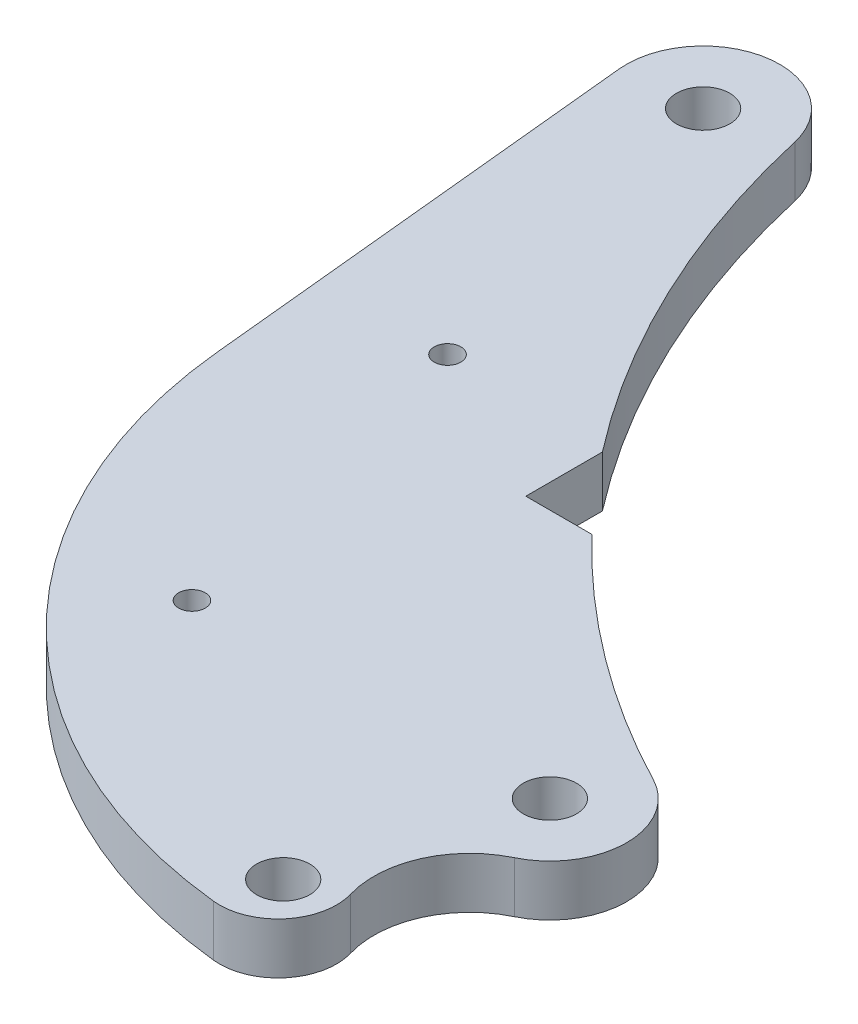
ISO-10303-21;
HEADER;
FILE_DESCRIPTION(('STEP AP214'),'2;1');
FILE_NAME('part.step','',(''),(''),'','','');
FILE_SCHEMA(('AUTOMOTIVE_DESIGN { 1 0 10303 214 1 1 1 1 }'));
ENDSEC;
DATA;
#1=APPLICATION_CONTEXT('core data for automotive mechanical design processes');
#2=APPLICATION_PROTOCOL_DEFINITION('international standard','automotive_design',2000,#1);
#3=PRODUCT_CONTEXT('',#1,'mechanical');
#4=PRODUCT('Part','Part','',(#3));
#5=PRODUCT_RELATED_PRODUCT_CATEGORY('part','',(#4));
#6=PRODUCT_DEFINITION_FORMATION('','',#4);
#7=PRODUCT_DEFINITION_CONTEXT('part definition',#1,'design');
#8=PRODUCT_DEFINITION('design','',#6,#7);
#9=PRODUCT_DEFINITION_SHAPE('','',#8);
#10=(LENGTH_UNIT() NAMED_UNIT(*) SI_UNIT(.MILLI.,.METRE.));
#11=(NAMED_UNIT(*) PLANE_ANGLE_UNIT() SI_UNIT($,.RADIAN.));
#12=(NAMED_UNIT(*) SI_UNIT($,.STERADIAN.) SOLID_ANGLE_UNIT());
#13=UNCERTAINTY_MEASURE_WITH_UNIT(LENGTH_MEASURE(1.E-05),#10,'distance_accuracy_value','');
#14=(GEOMETRIC_REPRESENTATION_CONTEXT(3) GLOBAL_UNCERTAINTY_ASSIGNED_CONTEXT((#13)) GLOBAL_UNIT_ASSIGNED_CONTEXT((#10,
#11,#12)) REPRESENTATION_CONTEXT('',''));
#15=CARTESIAN_POINT('',(0.,0.,0.));
#16=DIRECTION('',(0.,0.,1.));
#17=DIRECTION('',(1.,0.,0.));
#18=AXIS2_PLACEMENT_3D('',#15,#16,#17);
#19=CARTESIAN_POINT('',(0.,3.048,0.));
#20=DIRECTION('',(0.,1.,0.));
#21=DIRECTION('',(0.,0.,1.));
#22=AXIS2_PLACEMENT_3D('',#19,#20,#21);
#23=PLANE('',#22);
#24=CARTESIAN_POINT('',(10.16,3.048,40.64));
#25=DIRECTION('',(0.,1.,0.));
#26=DIRECTION('',(0.,0.,1.));
#27=AXIS2_PLACEMENT_3D('',#24,#25,#26);
#28=CIRCLE('',#27,1.5875);
#29=CARTESIAN_POINT('',(10.16,3.048,42.2275));
#30=VERTEX_POINT('',#29);
#31=EDGE_CURVE('E233',#30,#30,#28,.T.);
#32=ORIENTED_EDGE('',*,*,#31,.F.);
#33=EDGE_LOOP('',(#32));
#34=FACE_BOUND('',#33,.T.);
#35=CARTESIAN_POINT('',(62.1230111231787,3.048,80.394598630688));
#36=DIRECTION('',(0.,1.,0.));
#37=DIRECTION('',(0.,0.,1.));
#38=AXIS2_PLACEMENT_3D('',#35,#36,#37);
#39=CIRCLE('',#38,3.175);
#40=CARTESIAN_POINT('',(62.1230111231787,3.048,83.569598630688));
#41=VERTEX_POINT('',#40);
#42=EDGE_CURVE('E221',#41,#41,#39,.T.);
#43=ORIENTED_EDGE('',*,*,#42,.F.);
#44=EDGE_LOOP('',(#43));
#45=FACE_BOUND('',#44,.T.);
#46=CARTESIAN_POINT('',(0.,3.048,0.));
#47=DIRECTION('',(0.,1.,0.));
#48=DIRECTION('',(0.,0.,1.));
#49=AXIS2_PLACEMENT_3D('',#46,#47,#48);
#50=CIRCLE('',#49,9.14400000000001);
#51=CARTESIAN_POINT('',(8.91502982381273,3.048,-2.03346483631509));
#52=VERTEX_POINT('',#51);
#53=CARTESIAN_POINT('',(-9.09923524379032,3.048,0.903689093750812));
#54=VERTEX_POINT('',#53);
#55=EDGE_CURVE('E170',#52,#54,#50,.T.);
#56=ORIENTED_EDGE('',*,*,#55,.T.);
#57=DIRECTION('',(0.0988286410488635,0.,0.995104466731224));
#58=VECTOR('',#57,1.);
#59=CARTESIAN_POINT('',(-9.09923524379032,3.048,0.903689093750812));
#60=LINE('',#59,#58);
#61=CARTESIAN_POINT('',(-3.80757133563289,3.048,54.1853930164458));
#62=VERTEX_POINT('',#61);
#63=EDGE_CURVE('E108',#54,#62,#60,.T.);
#64=ORIENTED_EDGE('',*,*,#63,.T.);
#65=CARTESIAN_POINT('',(59.3815623017999,3.048,47.9097743098429));
#66=DIRECTION('',(0.,1.,0.));
#67=DIRECTION('',(0.,0.,-1.));
#68=AXIS2_PLACEMENT_3D('',#65,#66,#67);
#69=CIRCLE('',#68,63.5);
#70=CARTESIAN_POINT('',(52.6784219206597,3.048,111.054987184856));
#71=VERTEX_POINT('',#70);
#72=EDGE_CURVE('E191',#62,#71,#69,.T.);
#73=ORIENTED_EDGE('',*,*,#72,.T.);
#74=CARTESIAN_POINT('',(53.4157673625851,3.048,104.109013768605));
#75=DIRECTION('',(0.,1.,0.));
#76=DIRECTION('',(0.,0.,1.));
#77=AXIS2_PLACEMENT_3D('',#74,#75,#76);
#78=CIRCLE('',#77,6.985);
#79=CARTESIAN_POINT('',(60.1171702292743,3.048,102.138880621243));
#80=VERTEX_POINT('',#79);
#81=EDGE_CURVE('E210',#71,#80,#78,.T.);
#82=ORIENTED_EDGE('',*,*,#81,.T.);
#83=CARTESIAN_POINT('',(71.0831021929474,3.048,98.9150263801071));
#84=DIRECTION('',(0.,-1.,0.));
#85=DIRECTION('',(0.,0.,-1.));
#86=AXIS2_PLACEMENT_3D('',#83,#84,#85);
#87=CIRCLE('',#86,11.43);
#88=CARTESIAN_POINT('',(66.1052738208537,3.048,88.6258998526521));
#89=VERTEX_POINT('',#88);
#90=EDGE_CURVE('E207',#80,#89,#87,.T.);
#91=ORIENTED_EDGE('',*,*,#90,.T.);
#92=CARTESIAN_POINT('',(62.1230111231787,3.048,80.394598630688));
#93=DIRECTION('',(0.,1.,0.));
#94=DIRECTION('',(0.,0.,1.));
#95=AXIS2_PLACEMENT_3D('',#92,#93,#94);
#96=CIRCLE('',#95,9.144);
#97=CARTESIAN_POINT('',(66.3396619544821,3.048,72.2808700323882));
#98=VERTEX_POINT('',#97);
#99=EDGE_CURVE('E209',#89,#98,#96,.T.);
#100=ORIENTED_EDGE('',*,*,#99,.T.);
#101=CARTESIAN_POINT('',(117.876505448191,3.048,-26.8869239468317));
#102=DIRECTION('',(0.,-1.,0.));
#103=DIRECTION('',(0.,0.,1.));
#104=AXIS2_PLACEMENT_3D('',#101,#102,#103);
#105=CIRCLE('',#104,111.76);
#106=CARTESIAN_POINT('',(37.3478982086017,3.048,50.6078566261337));
#107=VERTEX_POINT('',#106);
#108=EDGE_CURVE('E133',#98,#107,#105,.T.);
#109=ORIENTED_EDGE('',*,*,#108,.T.);
#110=DIRECTION('',(-1.,0.,0.));
#111=VECTOR('',#110,1.);
#112=CARTESIAN_POINT('',(29.464,3.048,50.6078566261337));
#113=LINE('',#112,#111);
#114=CARTESIAN_POINT('',(29.464,3.048,50.6078566261337));
#115=VERTEX_POINT('',#114);
#116=EDGE_CURVE('E127',#107,#115,#113,.T.);
#117=ORIENTED_EDGE('',*,*,#116,.T.);
#118=DIRECTION('',(0.,0.,-1.));
#119=VECTOR('',#118,1.);
#120=CARTESIAN_POINT('',(29.464,3.048,41.4762714171482));
#121=LINE('',#120,#119);
#122=CARTESIAN_POINT('',(29.464,3.048,41.4762714171481));
#123=VERTEX_POINT('',#122);
#124=EDGE_CURVE('E131',#115,#123,#121,.T.);
#125=ORIENTED_EDGE('',*,*,#124,.T.);
#126=CARTESIAN_POINT('',(117.876505448191,3.048,-26.8869239468317));
#127=DIRECTION('',(0.,-1.,0.));
#128=DIRECTION('',(0.,0.,1.));
#129=AXIS2_PLACEMENT_3D('',#126,#127,#128);
#130=CIRCLE('',#129,111.76);
#131=EDGE_CURVE('E59',#123,#52,#130,.T.);
#132=ORIENTED_EDGE('',*,*,#131,.T.);
#133=EDGE_LOOP('',(#56,#64,#73,#82,#91,#100,#109,#117,#125,#132));
#134=FACE_BOUND('',#133,.T.);
#135=CARTESIAN_POINT('',(0.,3.048,0.));
#136=DIRECTION('',(0.,1.,0.));
#137=DIRECTION('',(0.,0.,1.));
#138=AXIS2_PLACEMENT_3D('',#135,#136,#137);
#139=CIRCLE('',#138,3.175);
#140=CARTESIAN_POINT('',(0.,3.048,3.175));
#141=VERTEX_POINT('',#140);
#142=EDGE_CURVE('E155',#141,#141,#139,.T.);
#143=ORIENTED_EDGE('',*,*,#142,.F.);
#144=EDGE_LOOP('',(#143));
#145=FACE_BOUND('',#144,.T.);
#146=CARTESIAN_POINT('',(54.5672350025058,3.048,104.644758366539));
#147=DIRECTION('',(0.,1.,0.));
#148=DIRECTION('',(0.,0.,1.));
#149=AXIS2_PLACEMENT_3D('',#146,#147,#148);
#150=CIRCLE('',#149,3.175);
#151=CARTESIAN_POINT('',(54.5672350025058,3.048,107.819758366539));
#152=VERTEX_POINT('',#151);
#153=EDGE_CURVE('E227',#152,#152,#150,.T.);
#154=ORIENTED_EDGE('',*,*,#153,.F.);
#155=EDGE_LOOP('',(#154));
#156=FACE_BOUND('',#155,.T.);
#157=CARTESIAN_POINT('',(20.32,3.048,81.28));
#158=DIRECTION('',(0.,1.,0.));
#159=DIRECTION('',(0.,0.,1.));
#160=AXIS2_PLACEMENT_3D('',#157,#158,#159);
#161=CIRCLE('',#160,1.58750000000001);
#162=CARTESIAN_POINT('',(20.32,3.048,82.8675));
#163=VERTEX_POINT('',#162);
#164=EDGE_CURVE('E239',#163,#163,#161,.T.);
#165=ORIENTED_EDGE('',*,*,#164,.F.);
#166=EDGE_LOOP('',(#165));
#167=FACE_BOUND('',#166,.T.);
#168=ADVANCED_FACE('F42',(#34,#45,#134,#145,#156,#167),#23,.T.);
#169=CARTESIAN_POINT('',(0.,-3.048,0.));
#170=DIRECTION('',(0.,1.,0.));
#171=DIRECTION('',(0.,0.,1.));
#172=AXIS2_PLACEMENT_3D('',#169,#170,#171);
#173=PLANE('',#172);
#174=CARTESIAN_POINT('',(0.,-3.048,0.));
#175=DIRECTION('',(0.,1.,0.));
#176=DIRECTION('',(0.,0.,1.));
#177=AXIS2_PLACEMENT_3D('',#174,#175,#176);
#178=CIRCLE('',#177,9.14400000000001);
#179=CARTESIAN_POINT('',(8.91502982381273,-3.048,-2.03346483631509));
#180=VERTEX_POINT('',#179);
#181=CARTESIAN_POINT('',(-9.09923524379032,-3.048,0.903689093750812));
#182=VERTEX_POINT('',#181);
#183=EDGE_CURVE('E151',#180,#182,#178,.T.);
#184=ORIENTED_EDGE('',*,*,#183,.F.);
#185=CARTESIAN_POINT('',(117.876505448191,-3.048,-26.8869239468317));
#186=DIRECTION('',(0.,-1.,0.));
#187=DIRECTION('',(0.,0.,1.));
#188=AXIS2_PLACEMENT_3D('',#185,#186,#187);
#189=CIRCLE('',#188,111.76);
#190=CARTESIAN_POINT('',(29.464,-3.048,41.4762714171481));
#191=VERTEX_POINT('',#190);
#192=EDGE_CURVE('E100',#191,#180,#189,.T.);
#193=ORIENTED_EDGE('',*,*,#192,.F.);
#194=DIRECTION('',(0.,0.,-1.));
#195=VECTOR('',#194,1.);
#196=CARTESIAN_POINT('',(29.464,-3.048,41.4762714171482));
#197=LINE('',#196,#195);
#198=CARTESIAN_POINT('',(29.464,-3.048,50.6078566261337));
#199=VERTEX_POINT('',#198);
#200=EDGE_CURVE('E94',#199,#191,#197,.T.);
#201=ORIENTED_EDGE('',*,*,#200,.F.);
#202=DIRECTION('',(-1.,0.,0.));
#203=VECTOR('',#202,1.);
#204=CARTESIAN_POINT('',(29.464,-3.048,50.6078566261337));
#205=LINE('',#204,#203);
#206=CARTESIAN_POINT('',(37.3478982086017,-3.048,50.6078566261337));
#207=VERTEX_POINT('',#206);
#208=EDGE_CURVE('E141',#207,#199,#205,.T.);
#209=ORIENTED_EDGE('',*,*,#208,.F.);
#210=CARTESIAN_POINT('',(117.876505448191,-3.048,-26.8869239468317));
#211=DIRECTION('',(0.,-1.,0.));
#212=DIRECTION('',(0.,0.,1.));
#213=AXIS2_PLACEMENT_3D('',#210,#211,#212);
#214=CIRCLE('',#213,111.76);
#215=CARTESIAN_POINT('',(66.3396619544821,-3.048,72.2808700323882));
#216=VERTEX_POINT('',#215);
#217=EDGE_CURVE('E165',#216,#207,#214,.T.);
#218=ORIENTED_EDGE('',*,*,#217,.F.);
#219=CARTESIAN_POINT('',(62.1230111231787,-3.048,80.394598630688));
#220=DIRECTION('',(0.,1.,0.));
#221=DIRECTION('',(0.,0.,1.));
#222=AXIS2_PLACEMENT_3D('',#219,#220,#221);
#223=CIRCLE('',#222,9.144);
#224=CARTESIAN_POINT('',(66.1052738208537,-3.048,88.6258998526521));
#225=VERTEX_POINT('',#224);
#226=EDGE_CURVE('E163',#225,#216,#223,.T.);
#227=ORIENTED_EDGE('',*,*,#226,.F.);
#228=CARTESIAN_POINT('',(71.0831021929474,-3.048,98.9150263801071));
#229=DIRECTION('',(0.,-1.,0.));
#230=DIRECTION('',(0.,0.,-1.));
#231=AXIS2_PLACEMENT_3D('',#228,#229,#230);
#232=CIRCLE('',#231,11.43);
#233=CARTESIAN_POINT('',(60.1171702292743,-3.048,102.138880621243));
#234=VERTEX_POINT('',#233);
#235=EDGE_CURVE('E161',#234,#225,#232,.T.);
#236=ORIENTED_EDGE('',*,*,#235,.F.);
#237=CARTESIAN_POINT('',(53.4157673625851,-3.048,104.109013768605));
#238=DIRECTION('',(0.,1.,0.));
#239=DIRECTION('',(0.,0.,1.));
#240=AXIS2_PLACEMENT_3D('',#237,#238,#239);
#241=CIRCLE('',#240,6.985);
#242=CARTESIAN_POINT('',(52.6784219206597,-3.048,111.054987184856));
#243=VERTEX_POINT('',#242);
#244=EDGE_CURVE('E159',#243,#234,#241,.T.);
#245=ORIENTED_EDGE('',*,*,#244,.F.);
#246=CARTESIAN_POINT('',(59.3815623017999,-3.048,47.9097743098429));
#247=DIRECTION('',(0.,1.,0.));
#248=DIRECTION('',(0.,0.,-1.));
#249=AXIS2_PLACEMENT_3D('',#246,#247,#248);
#250=CIRCLE('',#249,63.5);
#251=CARTESIAN_POINT('',(-3.80757133563289,-3.048,54.1853930164458));
#252=VERTEX_POINT('',#251);
#253=EDGE_CURVE('E157',#252,#243,#250,.T.);
#254=ORIENTED_EDGE('',*,*,#253,.F.);
#255=DIRECTION('',(0.0988286410488635,0.,0.995104466731224));
#256=VECTOR('',#255,1.);
#257=CARTESIAN_POINT('',(-9.09923524379032,-3.048,0.903689093750812));
#258=LINE('',#257,#256);
#259=EDGE_CURVE('E154',#182,#252,#258,.T.);
#260=ORIENTED_EDGE('',*,*,#259,.F.);
#261=EDGE_LOOP('',(#184,#193,#201,#209,#218,#227,#236,#245,#254,#260));
#262=FACE_BOUND('',#261,.T.);
#263=CARTESIAN_POINT('',(0.,-3.048,0.));
#264=DIRECTION('',(0.,1.,0.));
#265=DIRECTION('',(0.,0.,1.));
#266=AXIS2_PLACEMENT_3D('',#263,#264,#265);
#267=CIRCLE('',#266,3.175);
#268=CARTESIAN_POINT('',(0.,-3.048,3.175));
#269=VERTEX_POINT('',#268);
#270=EDGE_CURVE('E218',#269,#269,#267,.T.);
#271=ORIENTED_EDGE('',*,*,#270,.T.);
#272=EDGE_LOOP('',(#271));
#273=FACE_BOUND('',#272,.T.);
#274=CARTESIAN_POINT('',(62.1230111231787,-3.048,80.394598630688));
#275=DIRECTION('',(0.,1.,0.));
#276=DIRECTION('',(0.,0.,1.));
#277=AXIS2_PLACEMENT_3D('',#274,#275,#276);
#278=CIRCLE('',#277,3.175);
#279=CARTESIAN_POINT('',(62.1230111231787,-3.048,83.569598630688));
#280=VERTEX_POINT('',#279);
#281=EDGE_CURVE('E224',#280,#280,#278,.T.);
#282=ORIENTED_EDGE('',*,*,#281,.T.);
#283=EDGE_LOOP('',(#282));
#284=FACE_BOUND('',#283,.T.);
#285=CARTESIAN_POINT('',(54.5672350025058,-3.048,104.644758366539));
#286=DIRECTION('',(0.,1.,0.));
#287=DIRECTION('',(0.,0.,1.));
#288=AXIS2_PLACEMENT_3D('',#285,#286,#287);
#289=CIRCLE('',#288,3.175);
#290=CARTESIAN_POINT('',(54.5672350025058,-3.048,107.819758366539));
#291=VERTEX_POINT('',#290);
#292=EDGE_CURVE('E230',#291,#291,#289,.T.);
#293=ORIENTED_EDGE('',*,*,#292,.T.);
#294=EDGE_LOOP('',(#293));
#295=FACE_BOUND('',#294,.T.);
#296=CARTESIAN_POINT('',(10.16,-3.048,40.64));
#297=DIRECTION('',(0.,1.,0.));
#298=DIRECTION('',(0.,0.,1.));
#299=AXIS2_PLACEMENT_3D('',#296,#297,#298);
#300=CIRCLE('',#299,1.5875);
#301=CARTESIAN_POINT('',(10.16,-3.048,42.2275));
#302=VERTEX_POINT('',#301);
#303=EDGE_CURVE('E236',#302,#302,#300,.T.);
#304=ORIENTED_EDGE('',*,*,#303,.T.);
#305=EDGE_LOOP('',(#304));
#306=FACE_BOUND('',#305,.T.);
#307=CARTESIAN_POINT('',(20.32,-3.048,81.28));
#308=DIRECTION('',(0.,1.,0.));
#309=DIRECTION('',(0.,0.,1.));
#310=AXIS2_PLACEMENT_3D('',#307,#308,#309);
#311=CIRCLE('',#310,1.58750000000001);
#312=CARTESIAN_POINT('',(20.32,-3.048,82.8675));
#313=VERTEX_POINT('',#312);
#314=EDGE_CURVE('E242',#313,#313,#311,.T.);
#315=ORIENTED_EDGE('',*,*,#314,.T.);
#316=EDGE_LOOP('',(#315));
#317=FACE_BOUND('',#316,.T.);
#318=ADVANCED_FACE('F195',(#262,#273,#284,#295,#306,#317),#173,.F.);
#319=CARTESIAN_POINT('',(0.,3.048,0.));
#320=DIRECTION('',(0.,-1.,0.));
#321=DIRECTION('',(0.,0.,-1.));
#322=AXIS2_PLACEMENT_3D('',#319,#320,#321);
#323=CYLINDRICAL_SURFACE('',#322,9.14400000000001);
#324=ORIENTED_EDGE('',*,*,#183,.T.);
#325=DIRECTION('',(0.,-1.,0.));
#326=VECTOR('',#325,1.);
#327=CARTESIAN_POINT('',(-9.09923524379032,3.048,0.903689093750812));
#328=LINE('',#327,#326);
#329=EDGE_CURVE('E13',#54,#182,#328,.T.);
#330=ORIENTED_EDGE('',*,*,#329,.F.);
#331=ORIENTED_EDGE('',*,*,#55,.F.);
#332=DIRECTION('',(0.,-1.,0.));
#333=VECTOR('',#332,1.);
#334=CARTESIAN_POINT('',(8.91502982381273,3.048,-2.03346483631509));
#335=LINE('',#334,#333);
#336=EDGE_CURVE('E147',#52,#180,#335,.T.);
#337=ORIENTED_EDGE('',*,*,#336,.T.);
#338=EDGE_LOOP('',(#324,#330,#331,#337));
#339=FACE_BOUND('',#338,.T.);
#340=ADVANCED_FACE('F44',(#339),#323,.T.);
#341=CARTESIAN_POINT('',(-9.09923524379032,3.048,0.903689093750812));
#342=DIRECTION('',(0.995104466731225,0.,-0.0988286410488635));
#343=DIRECTION('',(-0.0988286410488635,0.,-0.995104466731225));
#344=AXIS2_PLACEMENT_3D('',#341,#342,#343);
#345=PLANE('',#344);
#346=ORIENTED_EDGE('',*,*,#259,.T.);
#347=DIRECTION('',(0.,-1.,0.));
#348=VECTOR('',#347,1.);
#349=CARTESIAN_POINT('',(-3.80757133563289,3.048,54.1853930164458));
#350=LINE('',#349,#348);
#351=EDGE_CURVE('E51',#62,#252,#350,.T.);
#352=ORIENTED_EDGE('',*,*,#351,.F.);
#353=ORIENTED_EDGE('',*,*,#63,.F.);
#354=ORIENTED_EDGE('',*,*,#329,.T.);
#355=EDGE_LOOP('',(#346,#352,#353,#354));
#356=FACE_BOUND('',#355,.T.);
#357=ADVANCED_FACE('F284',(#356),#345,.F.);
#358=CARTESIAN_POINT('',(59.3815623017999,3.048,47.9097743098429));
#359=DIRECTION('',(0.,-1.,0.));
#360=DIRECTION('',(0.,0.,-1.));
#361=AXIS2_PLACEMENT_3D('',#358,#359,#360);
#362=CYLINDRICAL_SURFACE('',#361,63.5);
#363=ORIENTED_EDGE('',*,*,#253,.T.);
#364=DIRECTION('',(0.,-1.,0.));
#365=VECTOR('',#364,1.);
#366=CARTESIAN_POINT('',(52.6784219206597,3.048,111.054987184856));
#367=LINE('',#366,#365);
#368=EDGE_CURVE('E183',#71,#243,#367,.T.);
#369=ORIENTED_EDGE('',*,*,#368,.F.);
#370=ORIENTED_EDGE('',*,*,#72,.F.);
#371=ORIENTED_EDGE('',*,*,#351,.T.);
#372=EDGE_LOOP('',(#363,#369,#370,#371));
#373=FACE_BOUND('',#372,.T.);
#374=ADVANCED_FACE('F189',(#373),#362,.T.);
#375=CARTESIAN_POINT('',(53.4157673625851,3.048,104.109013768605));
#376=DIRECTION('',(0.,-1.,0.));
#377=DIRECTION('',(0.,0.,-1.));
#378=AXIS2_PLACEMENT_3D('',#375,#376,#377);
#379=CYLINDRICAL_SURFACE('',#378,6.985);
#380=ORIENTED_EDGE('',*,*,#244,.T.);
#381=DIRECTION('',(0.,-1.,0.));
#382=VECTOR('',#381,1.);
#383=CARTESIAN_POINT('',(60.1171702292743,3.048,102.138880621243));
#384=LINE('',#383,#382);
#385=EDGE_CURVE('E180',#80,#234,#384,.T.);
#386=ORIENTED_EDGE('',*,*,#385,.F.);
#387=ORIENTED_EDGE('',*,*,#81,.F.);
#388=ORIENTED_EDGE('',*,*,#368,.T.);
#389=EDGE_LOOP('',(#380,#386,#387,#388));
#390=FACE_BOUND('',#389,.T.);
#391=ADVANCED_FACE('F201',(#390),#379,.T.);
#392=CARTESIAN_POINT('',(71.0831021929474,3.048,98.9150263801071));
#393=DIRECTION('',(0.,-1.,0.));
#394=DIRECTION('',(0.,0.,-1.));
#395=AXIS2_PLACEMENT_3D('',#392,#393,#394);
#396=CYLINDRICAL_SURFACE('',#395,11.43);
#397=ORIENTED_EDGE('',*,*,#235,.T.);
#398=DIRECTION('',(0.,-1.,0.));
#399=VECTOR('',#398,1.);
#400=CARTESIAN_POINT('',(66.1052738208537,3.048,88.6258998526521));
#401=LINE('',#400,#399);
#402=EDGE_CURVE('E177',#89,#225,#401,.T.);
#403=ORIENTED_EDGE('',*,*,#402,.F.);
#404=ORIENTED_EDGE('',*,*,#90,.F.);
#405=ORIENTED_EDGE('',*,*,#385,.T.);
#406=EDGE_LOOP('',(#397,#403,#404,#405));
#407=FACE_BOUND('',#406,.T.);
#408=ADVANCED_FACE('F205',(#407),#396,.F.);
#409=CARTESIAN_POINT('',(62.1230111231787,3.048,80.394598630688));
#410=DIRECTION('',(0.,-1.,0.));
#411=DIRECTION('',(0.,0.,-1.));
#412=AXIS2_PLACEMENT_3D('',#409,#410,#411);
#413=CYLINDRICAL_SURFACE('',#412,9.144);
#414=ORIENTED_EDGE('',*,*,#226,.T.);
#415=DIRECTION('',(0.,-1.,0.));
#416=VECTOR('',#415,1.);
#417=CARTESIAN_POINT('',(66.3396619544821,3.048,72.2808700323882));
#418=LINE('',#417,#416);
#419=EDGE_CURVE('E174',#98,#216,#418,.T.);
#420=ORIENTED_EDGE('',*,*,#419,.F.);
#421=ORIENTED_EDGE('',*,*,#99,.F.);
#422=ORIENTED_EDGE('',*,*,#402,.T.);
#423=EDGE_LOOP('',(#414,#420,#421,#422));
#424=FACE_BOUND('',#423,.T.);
#425=ADVANCED_FACE('F274',(#424),#413,.T.);
#426=CARTESIAN_POINT('',(117.876505448191,3.048,-26.8869239468317));
#427=DIRECTION('',(0.,-1.,0.));
#428=DIRECTION('',(0.,0.,-1.));
#429=AXIS2_PLACEMENT_3D('',#426,#427,#428);
#430=CYLINDRICAL_SURFACE('',#429,111.76);
#431=ORIENTED_EDGE('',*,*,#217,.T.);
#432=DIRECTION('',(0.,-1.,0.));
#433=VECTOR('',#432,1.);
#434=CARTESIAN_POINT('',(37.3478982086017,3.048,50.6078566261337));
#435=LINE('',#434,#433);
#436=EDGE_CURVE('E142',#107,#207,#435,.T.);
#437=ORIENTED_EDGE('',*,*,#436,.F.);
#438=ORIENTED_EDGE('',*,*,#108,.F.);
#439=ORIENTED_EDGE('',*,*,#419,.T.);
#440=EDGE_LOOP('',(#431,#437,#438,#439));
#441=FACE_BOUND('',#440,.T.);
#442=ADVANCED_FACE('F271',(#441),#430,.F.);
#443=CARTESIAN_POINT('',(29.464,3.048,50.6078566261337));
#444=DIRECTION('',(0.,0.,1.));
#445=DIRECTION('',(1.,0.,0.));
#446=AXIS2_PLACEMENT_3D('',#443,#444,#445);
#447=PLANE('',#446);
#448=ORIENTED_EDGE('',*,*,#208,.T.);
#449=DIRECTION('',(0.,-1.,0.));
#450=VECTOR('',#449,1.);
#451=CARTESIAN_POINT('',(29.464,3.048,50.6078566261337));
#452=LINE('',#451,#450);
#453=EDGE_CURVE('E138',#115,#199,#452,.T.);
#454=ORIENTED_EDGE('',*,*,#453,.F.);
#455=ORIENTED_EDGE('',*,*,#116,.F.);
#456=ORIENTED_EDGE('',*,*,#436,.T.);
#457=EDGE_LOOP('',(#448,#454,#455,#456));
#458=FACE_BOUND('',#457,.T.);
#459=ADVANCED_FACE('F139',(#458),#447,.F.);
#460=CARTESIAN_POINT('',(29.464,3.048,41.4762714171482));
#461=DIRECTION('',(-1.,0.,0.));
#462=DIRECTION('',(0.,0.,1.));
#463=AXIS2_PLACEMENT_3D('',#460,#461,#462);
#464=PLANE('',#463);
#465=ORIENTED_EDGE('',*,*,#200,.T.);
#466=DIRECTION('',(0.,-1.,0.));
#467=VECTOR('',#466,1.);
#468=CARTESIAN_POINT('',(29.464,3.048,41.4762714171481));
#469=LINE('',#468,#467);
#470=EDGE_CURVE('E143',#123,#191,#469,.T.);
#471=ORIENTED_EDGE('',*,*,#470,.F.);
#472=ORIENTED_EDGE('',*,*,#124,.F.);
#473=ORIENTED_EDGE('',*,*,#453,.T.);
#474=EDGE_LOOP('',(#465,#471,#472,#473));
#475=FACE_BOUND('',#474,.T.);
#476=ADVANCED_FACE('F145',(#475),#464,.F.);
#477=CARTESIAN_POINT('',(117.876505448191,3.048,-26.8869239468317));
#478=DIRECTION('',(0.,-1.,0.));
#479=DIRECTION('',(0.,0.,-1.));
#480=AXIS2_PLACEMENT_3D('',#477,#478,#479);
#481=CYLINDRICAL_SURFACE('',#480,111.76);
#482=ORIENTED_EDGE('',*,*,#192,.T.);
#483=ORIENTED_EDGE('',*,*,#336,.F.);
#484=ORIENTED_EDGE('',*,*,#131,.F.);
#485=ORIENTED_EDGE('',*,*,#470,.T.);
#486=EDGE_LOOP('',(#482,#483,#484,#485));
#487=FACE_BOUND('',#486,.T.);
#488=ADVANCED_FACE('F264',(#487),#481,.F.);
#489=CARTESIAN_POINT('',(0.,3.048,0.));
#490=DIRECTION('',(0.,-1.,0.));
#491=DIRECTION('',(0.,0.,-1.));
#492=AXIS2_PLACEMENT_3D('',#489,#490,#491);
#493=CYLINDRICAL_SURFACE('',#492,3.175);
#494=ORIENTED_EDGE('',*,*,#142,.T.);
#495=EDGE_LOOP('',(#494));
#496=FACE_BOUND('',#495,.T.);
#497=ORIENTED_EDGE('',*,*,#270,.F.);
#498=EDGE_LOOP('',(#497));
#499=FACE_BOUND('',#498,.T.);
#500=ADVANCED_FACE('F261',(#496,#499),#493,.F.);
#501=CARTESIAN_POINT('',(62.1230111231787,3.048,80.394598630688));
#502=DIRECTION('',(0.,-1.,0.));
#503=DIRECTION('',(0.,0.,-1.));
#504=AXIS2_PLACEMENT_3D('',#501,#502,#503);
#505=CYLINDRICAL_SURFACE('',#504,3.175);
#506=ORIENTED_EDGE('',*,*,#42,.T.);
#507=EDGE_LOOP('',(#506));
#508=FACE_BOUND('',#507,.T.);
#509=ORIENTED_EDGE('',*,*,#281,.F.);
#510=EDGE_LOOP('',(#509));
#511=FACE_BOUND('',#510,.T.);
#512=ADVANCED_FACE('F360',(#508,#511),#505,.F.);
#513=CARTESIAN_POINT('',(54.5672350025058,3.048,104.644758366539));
#514=DIRECTION('',(0.,-1.,0.));
#515=DIRECTION('',(0.,0.,-1.));
#516=AXIS2_PLACEMENT_3D('',#513,#514,#515);
#517=CYLINDRICAL_SURFACE('',#516,3.175);
#518=ORIENTED_EDGE('',*,*,#153,.T.);
#519=EDGE_LOOP('',(#518));
#520=FACE_BOUND('',#519,.T.);
#521=ORIENTED_EDGE('',*,*,#292,.F.);
#522=EDGE_LOOP('',(#521));
#523=FACE_BOUND('',#522,.T.);
#524=ADVANCED_FACE('F368',(#520,#523),#517,.F.);
#525=CARTESIAN_POINT('',(10.16,3.048,40.64));
#526=DIRECTION('',(0.,-1.,0.));
#527=DIRECTION('',(0.,0.,-1.));
#528=AXIS2_PLACEMENT_3D('',#525,#526,#527);
#529=CYLINDRICAL_SURFACE('',#528,1.5875);
#530=ORIENTED_EDGE('',*,*,#31,.T.);
#531=EDGE_LOOP('',(#530));
#532=FACE_BOUND('',#531,.T.);
#533=ORIENTED_EDGE('',*,*,#303,.F.);
#534=EDGE_LOOP('',(#533));
#535=FACE_BOUND('',#534,.T.);
#536=ADVANCED_FACE('F376',(#532,#535),#529,.F.);
#537=CARTESIAN_POINT('',(20.32,3.048,81.28));
#538=DIRECTION('',(0.,-1.,0.));
#539=DIRECTION('',(0.,0.,-1.));
#540=AXIS2_PLACEMENT_3D('',#537,#538,#539);
#541=CYLINDRICAL_SURFACE('',#540,1.58750000000001);
#542=ORIENTED_EDGE('',*,*,#164,.T.);
#543=EDGE_LOOP('',(#542));
#544=FACE_BOUND('',#543,.T.);
#545=ORIENTED_EDGE('',*,*,#314,.F.);
#546=EDGE_LOOP('',(#545));
#547=FACE_BOUND('',#546,.T.);
#548=ADVANCED_FACE('F248',(#544,#547),#541,.F.);
#549=CLOSED_SHELL('',(#168,#318,#340,#357,#374,#391,#408,#425,#442,#459,#476,#488,#500,#512,
#524,#536,#548));
#550=MANIFOLD_SOLID_BREP('B2',#549);
#551=ADVANCED_BREP_SHAPE_REPRESENTATION('',(#18,#550),#14);
#552=SHAPE_DEFINITION_REPRESENTATION(#9,#551);
ENDSEC;
END-ISO-10303-21;
